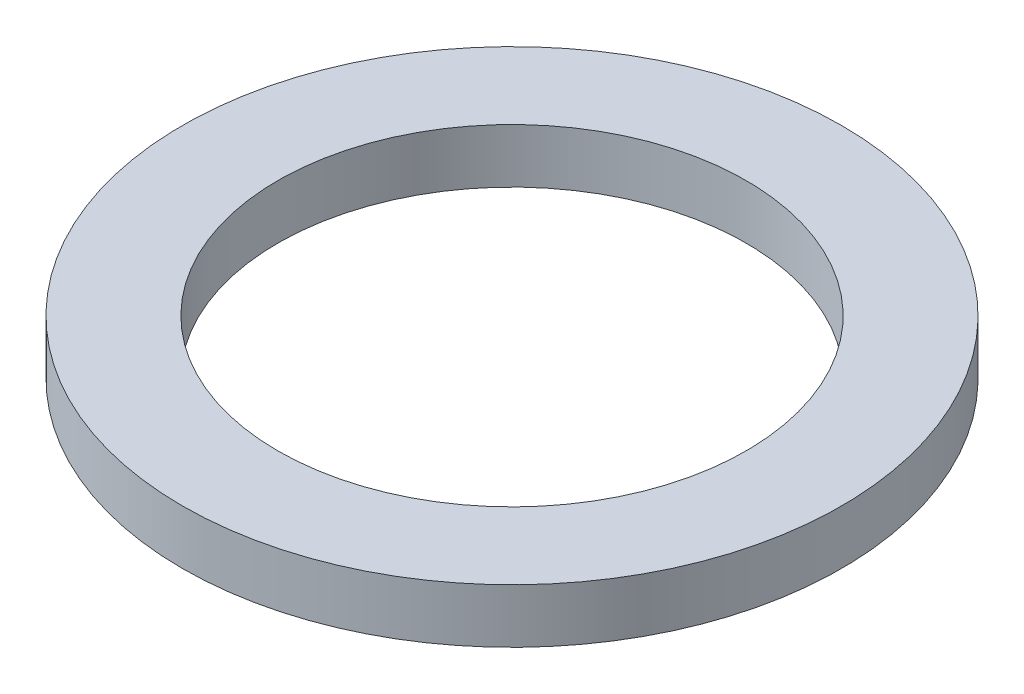
ISO-10303-21;
HEADER;
FILE_DESCRIPTION(('STEP AP214'),'2;1');
FILE_NAME('part.step','',(''),(''),'','','');
FILE_SCHEMA(('AUTOMOTIVE_DESIGN { 1 0 10303 214 1 1 1 1 }'));
ENDSEC;
DATA;
#1=APPLICATION_CONTEXT('core data for automotive mechanical design processes');
#2=APPLICATION_PROTOCOL_DEFINITION('international standard','automotive_design',2000,#1);
#3=PRODUCT_CONTEXT('',#1,'mechanical');
#4=PRODUCT('Part','Part','',(#3));
#5=PRODUCT_RELATED_PRODUCT_CATEGORY('part','',(#4));
#6=PRODUCT_DEFINITION_FORMATION('','',#4);
#7=PRODUCT_DEFINITION_CONTEXT('part definition',#1,'design');
#8=PRODUCT_DEFINITION('design','',#6,#7);
#9=PRODUCT_DEFINITION_SHAPE('','',#8);
#10=(LENGTH_UNIT() NAMED_UNIT(*) SI_UNIT(.MILLI.,.METRE.));
#11=(NAMED_UNIT(*) PLANE_ANGLE_UNIT() SI_UNIT($,.RADIAN.));
#12=(NAMED_UNIT(*) SI_UNIT($,.STERADIAN.) SOLID_ANGLE_UNIT());
#13=UNCERTAINTY_MEASURE_WITH_UNIT(LENGTH_MEASURE(1.E-05),#10,'distance_accuracy_value','');
#14=(GEOMETRIC_REPRESENTATION_CONTEXT(3) GLOBAL_UNCERTAINTY_ASSIGNED_CONTEXT((#13)) GLOBAL_UNIT_ASSIGNED_CONTEXT((#10,
#11,#12)) REPRESENTATION_CONTEXT('',''));
#15=CARTESIAN_POINT('',(0.,0.,0.));
#16=DIRECTION('',(0.,0.,1.));
#17=DIRECTION('',(1.,0.,0.));
#18=AXIS2_PLACEMENT_3D('',#15,#16,#17);
#19=CARTESIAN_POINT('',(0.,0.79375,0.));
#20=DIRECTION('',(0.,1.,0.));
#21=DIRECTION('',(0.,0.,1.));
#22=AXIS2_PLACEMENT_3D('',#19,#20,#21);
#23=PLANE('',#22);
#24=CARTESIAN_POINT('',(0.,0.79375,0.));
#25=DIRECTION('',(0.,1.,0.));
#26=DIRECTION('',(0.,0.,1.));
#27=AXIS2_PLACEMENT_3D('',#24,#25,#26);
#28=CIRCLE('',#27,4.826);
#29=CARTESIAN_POINT('',(0.,0.79375,4.826));
#30=VERTEX_POINT('',#29);
#31=EDGE_CURVE('E10',#30,#30,#28,.T.);
#32=ORIENTED_EDGE('',*,*,#31,.T.);
#33=EDGE_LOOP('',(#32));
#34=FACE_BOUND('',#33,.T.);
#35=CARTESIAN_POINT('',(0.,0.79375,0.));
#36=DIRECTION('',(0.,1.,0.));
#37=DIRECTION('',(0.,0.,1.));
#38=AXIS2_PLACEMENT_3D('',#35,#36,#37);
#39=CIRCLE('',#38,3.429);
#40=CARTESIAN_POINT('',(0.,0.79375,3.429));
#41=VERTEX_POINT('',#40);
#42=EDGE_CURVE('E56',#41,#41,#39,.T.);
#43=ORIENTED_EDGE('',*,*,#42,.F.);
#44=EDGE_LOOP('',(#43));
#45=FACE_BOUND('',#44,.T.);
#46=ADVANCED_FACE('F43',(#34,#45),#23,.T.);
#47=CARTESIAN_POINT('',(0.,0.,0.));
#48=DIRECTION('',(0.,1.,0.));
#49=DIRECTION('',(0.,0.,1.));
#50=AXIS2_PLACEMENT_3D('',#47,#48,#49);
#51=PLANE('',#50);
#52=CARTESIAN_POINT('',(0.,0.,0.));
#53=DIRECTION('',(0.,1.,0.));
#54=DIRECTION('',(0.,0.,1.));
#55=AXIS2_PLACEMENT_3D('',#52,#53,#54);
#56=CIRCLE('',#55,4.826);
#57=CARTESIAN_POINT('',(0.,0.,4.826));
#58=VERTEX_POINT('',#57);
#59=EDGE_CURVE('E47',#58,#58,#56,.T.);
#60=ORIENTED_EDGE('',*,*,#59,.F.);
#61=EDGE_LOOP('',(#60));
#62=FACE_BOUND('',#61,.T.);
#63=CARTESIAN_POINT('',(0.,0.,0.));
#64=DIRECTION('',(0.,1.,0.));
#65=DIRECTION('',(0.,0.,1.));
#66=AXIS2_PLACEMENT_3D('',#63,#64,#65);
#67=CIRCLE('',#66,3.429);
#68=CARTESIAN_POINT('',(0.,0.,3.429));
#69=VERTEX_POINT('',#68);
#70=EDGE_CURVE('E58',#69,#69,#67,.T.);
#71=ORIENTED_EDGE('',*,*,#70,.T.);
#72=EDGE_LOOP('',(#71));
#73=FACE_BOUND('',#72,.T.);
#74=ADVANCED_FACE('F70',(#62,#73),#51,.F.);
#75=CARTESIAN_POINT('',(0.,0.79375,0.));
#76=DIRECTION('',(0.,-1.,0.));
#77=DIRECTION('',(0.,0.,-1.));
#78=AXIS2_PLACEMENT_3D('',#75,#76,#77);
#79=CYLINDRICAL_SURFACE('',#78,4.826);
#80=ORIENTED_EDGE('',*,*,#31,.F.);
#81=EDGE_LOOP('',(#80));
#82=FACE_BOUND('',#81,.T.);
#83=ORIENTED_EDGE('',*,*,#59,.T.);
#84=EDGE_LOOP('',(#83));
#85=FACE_BOUND('',#84,.T.);
#86=ADVANCED_FACE('F45',(#82,#85),#79,.T.);
#87=CARTESIAN_POINT('',(0.,0.79375,0.));
#88=DIRECTION('',(0.,-1.,0.));
#89=DIRECTION('',(0.,0.,-1.));
#90=AXIS2_PLACEMENT_3D('',#87,#88,#89);
#91=CYLINDRICAL_SURFACE('',#90,3.429);
#92=ORIENTED_EDGE('',*,*,#42,.T.);
#93=EDGE_LOOP('',(#92));
#94=FACE_BOUND('',#93,.T.);
#95=ORIENTED_EDGE('',*,*,#70,.F.);
#96=EDGE_LOOP('',(#95));
#97=FACE_BOUND('',#96,.T.);
#98=ADVANCED_FACE('F66',(#94,#97),#91,.F.);
#99=CLOSED_SHELL('',(#46,#74,#86,#98));
#100=MANIFOLD_SOLID_BREP('B2',#99);
#101=ADVANCED_BREP_SHAPE_REPRESENTATION('',(#18,#100),#14);
#102=SHAPE_DEFINITION_REPRESENTATION(#9,#101);
ENDSEC;
END-ISO-10303-21;
